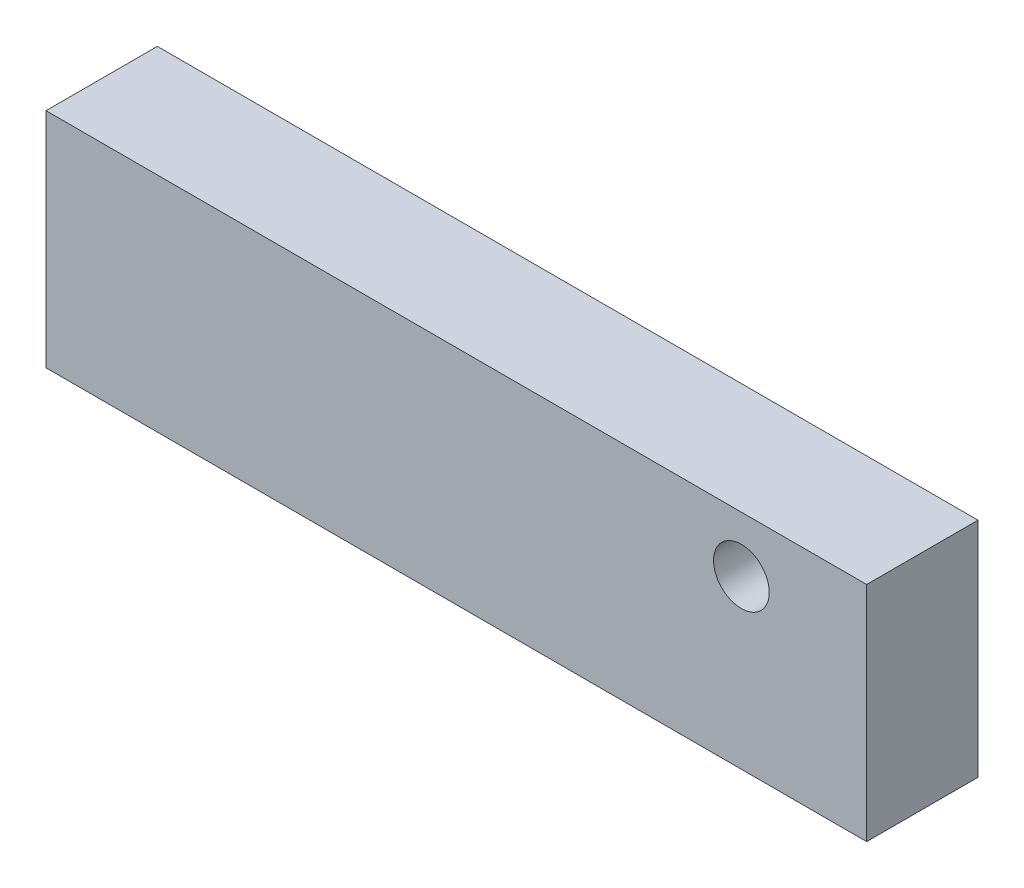
ISO-10303-21;
HEADER;
FILE_DESCRIPTION(('STEP AP214'),'2;1');
FILE_NAME('part.step','',(''),(''),'','','');
FILE_SCHEMA(('AUTOMOTIVE_DESIGN { 1 0 10303 214 1 1 1 1 }'));
ENDSEC;
DATA;
#1=APPLICATION_CONTEXT('core data for automotive mechanical design processes');
#2=APPLICATION_PROTOCOL_DEFINITION('international standard','automotive_design',2000,#1);
#3=PRODUCT_CONTEXT('',#1,'mechanical');
#4=PRODUCT('Part','Part','',(#3));
#5=PRODUCT_RELATED_PRODUCT_CATEGORY('part','',(#4));
#6=PRODUCT_DEFINITION_FORMATION('','',#4);
#7=PRODUCT_DEFINITION_CONTEXT('part definition',#1,'design');
#8=PRODUCT_DEFINITION('design','',#6,#7);
#9=PRODUCT_DEFINITION_SHAPE('','',#8);
#10=(LENGTH_UNIT() NAMED_UNIT(*) SI_UNIT(.MILLI.,.METRE.));
#11=(NAMED_UNIT(*) PLANE_ANGLE_UNIT() SI_UNIT($,.RADIAN.));
#12=(NAMED_UNIT(*) SI_UNIT($,.STERADIAN.) SOLID_ANGLE_UNIT());
#13=UNCERTAINTY_MEASURE_WITH_UNIT(LENGTH_MEASURE(1.E-05),#10,'distance_accuracy_value','');
#14=(GEOMETRIC_REPRESENTATION_CONTEXT(3) GLOBAL_UNCERTAINTY_ASSIGNED_CONTEXT((#13)) GLOBAL_UNIT_ASSIGNED_CONTEXT((#10,
#11,#12)) REPRESENTATION_CONTEXT('',''));
#15=CARTESIAN_POINT('',(0.,0.,0.));
#16=DIRECTION('',(0.,0.,1.));
#17=DIRECTION('',(1.,0.,0.));
#18=AXIS2_PLACEMENT_3D('',#15,#16,#17);
#19=CARTESIAN_POINT('',(0.,0.,25.4));
#20=DIRECTION('',(1.,0.,0.));
#21=DIRECTION('',(0.,0.,-1.));
#22=AXIS2_PLACEMENT_3D('',#19,#20,#21);
#23=PLANE('',#22);
#24=DIRECTION('',(0.,-1.,0.));
#25=VECTOR('',#24,1.);
#26=CARTESIAN_POINT('',(0.,0.,0.));
#27=LINE('',#26,#25);
#28=CARTESIAN_POINT('',(0.,50.8,0.));
#29=VERTEX_POINT('',#28);
#30=CARTESIAN_POINT('',(0.,0.,0.));
#31=VERTEX_POINT('',#30);
#32=EDGE_CURVE('E97',#29,#31,#27,.T.);
#33=ORIENTED_EDGE('',*,*,#32,.T.);
#34=DIRECTION('',(0.,0.,-1.));
#35=VECTOR('',#34,1.);
#36=CARTESIAN_POINT('',(0.,0.,25.4));
#37=LINE('',#36,#35);
#38=CARTESIAN_POINT('',(0.,0.,25.4));
#39=VERTEX_POINT('',#38);
#40=EDGE_CURVE('E11',#39,#31,#37,.T.);
#41=ORIENTED_EDGE('',*,*,#40,.F.);
#42=DIRECTION('',(0.,-1.,0.));
#43=VECTOR('',#42,1.);
#44=CARTESIAN_POINT('',(0.,0.,25.4));
#45=LINE('',#44,#43);
#46=CARTESIAN_POINT('',(0.,50.8,25.4));
#47=VERTEX_POINT('',#46);
#48=EDGE_CURVE('E84',#47,#39,#45,.T.);
#49=ORIENTED_EDGE('',*,*,#48,.F.);
#50=DIRECTION('',(0.,0.,-1.));
#51=VECTOR('',#50,1.);
#52=CARTESIAN_POINT('',(0.,50.8,25.4));
#53=LINE('',#52,#51);
#54=EDGE_CURVE('E93',#47,#29,#53,.T.);
#55=ORIENTED_EDGE('',*,*,#54,.T.);
#56=EDGE_LOOP('',(#33,#41,#49,#55));
#57=FACE_BOUND('',#56,.T.);
#58=ADVANCED_FACE('F32',(#57),#23,.F.);
#59=CARTESIAN_POINT('',(0.,0.,25.4));
#60=DIRECTION('',(0.,1.,0.));
#61=DIRECTION('',(0.,0.,1.));
#62=AXIS2_PLACEMENT_3D('',#59,#60,#61);
#63=PLANE('',#62);
#64=DIRECTION('',(1.,0.,0.));
#65=VECTOR('',#64,1.);
#66=CARTESIAN_POINT('',(0.,0.,0.));
#67=LINE('',#66,#65);
#68=CARTESIAN_POINT('',(187.198,0.,0.));
#69=VERTEX_POINT('',#68);
#70=EDGE_CURVE('E88',#31,#69,#67,.T.);
#71=ORIENTED_EDGE('',*,*,#70,.T.);
#72=DIRECTION('',(0.,0.,-1.));
#73=VECTOR('',#72,1.);
#74=CARTESIAN_POINT('',(187.198,0.,25.4));
#75=LINE('',#74,#73);
#76=CARTESIAN_POINT('',(187.198,0.,25.4));
#77=VERTEX_POINT('',#76);
#78=EDGE_CURVE('E41',#77,#69,#75,.T.);
#79=ORIENTED_EDGE('',*,*,#78,.F.);
#80=DIRECTION('',(1.,0.,0.));
#81=VECTOR('',#80,1.);
#82=CARTESIAN_POINT('',(0.,0.,25.4));
#83=LINE('',#82,#81);
#84=EDGE_CURVE('E79',#39,#77,#83,.T.);
#85=ORIENTED_EDGE('',*,*,#84,.F.);
#86=ORIENTED_EDGE('',*,*,#40,.T.);
#87=EDGE_LOOP('',(#71,#79,#85,#86));
#88=FACE_BOUND('',#87,.T.);
#89=ADVANCED_FACE('F87',(#88),#63,.F.);
#90=CARTESIAN_POINT('',(187.198,0.,25.4));
#91=DIRECTION('',(-1.,0.,0.));
#92=DIRECTION('',(0.,0.,1.));
#93=AXIS2_PLACEMENT_3D('',#90,#91,#92);
#94=PLANE('',#93);
#95=DIRECTION('',(0.,1.,0.));
#96=VECTOR('',#95,1.);
#97=CARTESIAN_POINT('',(187.198,0.,0.));
#98=LINE('',#97,#96);
#99=CARTESIAN_POINT('',(187.198,50.8,0.));
#100=VERTEX_POINT('',#99);
#101=EDGE_CURVE('E66',#69,#100,#98,.T.);
#102=ORIENTED_EDGE('',*,*,#101,.T.);
#103=DIRECTION('',(0.,0.,-1.));
#104=VECTOR('',#103,1.);
#105=CARTESIAN_POINT('',(187.198,50.8,25.4));
#106=LINE('',#105,#104);
#107=CARTESIAN_POINT('',(187.198,50.8,25.4));
#108=VERTEX_POINT('',#107);
#109=EDGE_CURVE('E89',#108,#100,#106,.T.);
#110=ORIENTED_EDGE('',*,*,#109,.F.);
#111=DIRECTION('',(0.,1.,0.));
#112=VECTOR('',#111,1.);
#113=CARTESIAN_POINT('',(187.198,0.,25.4));
#114=LINE('',#113,#112);
#115=EDGE_CURVE('E82',#77,#108,#114,.T.);
#116=ORIENTED_EDGE('',*,*,#115,.F.);
#117=ORIENTED_EDGE('',*,*,#78,.T.);
#118=EDGE_LOOP('',(#102,#110,#116,#117));
#119=FACE_BOUND('',#118,.T.);
#120=ADVANCED_FACE('F91',(#119),#94,.F.);
#121=CARTESIAN_POINT('',(0.,50.8,25.4));
#122=DIRECTION('',(0.,-1.,0.));
#123=DIRECTION('',(0.,0.,-1.));
#124=AXIS2_PLACEMENT_3D('',#121,#122,#123);
#125=PLANE('',#124);
#126=DIRECTION('',(-1.,0.,0.));
#127=VECTOR('',#126,1.);
#128=CARTESIAN_POINT('',(0.,50.8,0.));
#129=LINE('',#128,#127);
#130=EDGE_CURVE('E72',#100,#29,#129,.T.);
#131=ORIENTED_EDGE('',*,*,#130,.T.);
#132=ORIENTED_EDGE('',*,*,#54,.F.);
#133=DIRECTION('',(-1.,0.,0.));
#134=VECTOR('',#133,1.);
#135=CARTESIAN_POINT('',(0.,50.8,25.4));
#136=LINE('',#135,#134);
#137=EDGE_CURVE('E49',#108,#47,#136,.T.);
#138=ORIENTED_EDGE('',*,*,#137,.F.);
#139=ORIENTED_EDGE('',*,*,#109,.T.);
#140=EDGE_LOOP('',(#131,#132,#138,#139));
#141=FACE_BOUND('',#140,.T.);
#142=ADVANCED_FACE('F104',(#141),#125,.F.);
#143=CARTESIAN_POINT('',(0.,0.,25.4));
#144=DIRECTION('',(0.,0.,-1.));
#145=DIRECTION('',(-1.,0.,0.));
#146=AXIS2_PLACEMENT_3D('',#143,#144,#145);
#147=PLANE('',#146);
#148=CARTESIAN_POINT('',(158.623,38.1,25.4));
#149=DIRECTION('',(0.,0.,1.));
#150=DIRECTION('',(1.,0.,0.));
#151=AXIS2_PLACEMENT_3D('',#148,#149,#150);
#152=CIRCLE('',#151,6.35);
#153=CARTESIAN_POINT('',(164.973,38.1,25.4));
#154=VERTEX_POINT('',#153);
#155=EDGE_CURVE('E110',#154,#154,#152,.T.);
#156=ORIENTED_EDGE('',*,*,#155,.F.);
#157=EDGE_LOOP('',(#156));
#158=FACE_BOUND('',#157,.T.);
#159=ORIENTED_EDGE('',*,*,#48,.T.);
#160=ORIENTED_EDGE('',*,*,#84,.T.);
#161=ORIENTED_EDGE('',*,*,#115,.T.);
#162=ORIENTED_EDGE('',*,*,#137,.T.);
#163=EDGE_LOOP('',(#159,#160,#161,#162));
#164=FACE_BOUND('',#163,.T.);
#165=ADVANCED_FACE('F80',(#158,#164),#147,.F.);
#166=CARTESIAN_POINT('',(0.,0.,0.));
#167=DIRECTION('',(0.,0.,-1.));
#168=DIRECTION('',(-1.,0.,0.));
#169=AXIS2_PLACEMENT_3D('',#166,#167,#168);
#170=PLANE('',#169);
#171=CARTESIAN_POINT('',(158.623,38.1,0.));
#172=DIRECTION('',(0.,0.,-1.));
#173=DIRECTION('',(-1.,0.,0.));
#174=AXIS2_PLACEMENT_3D('',#171,#172,#173);
#175=CIRCLE('',#174,6.35);
#176=CARTESIAN_POINT('',(152.273,38.1,0.));
#177=VERTEX_POINT('',#176);
#178=EDGE_CURVE('E35',#177,#177,#175,.T.);
#179=ORIENTED_EDGE('',*,*,#178,.F.);
#180=EDGE_LOOP('',(#179));
#181=FACE_BOUND('',#180,.T.);
#182=ORIENTED_EDGE('',*,*,#32,.F.);
#183=ORIENTED_EDGE('',*,*,#130,.F.);
#184=ORIENTED_EDGE('',*,*,#101,.F.);
#185=ORIENTED_EDGE('',*,*,#70,.F.);
#186=EDGE_LOOP('',(#182,#183,#184,#185));
#187=FACE_BOUND('',#186,.T.);
#188=ADVANCED_FACE('F107',(#181,#187),#170,.T.);
#189=CARTESIAN_POINT('',(158.623,38.1,-228.6));
#190=DIRECTION('',(0.,0.,1.));
#191=DIRECTION('',(1.,0.,0.));
#192=AXIS2_PLACEMENT_3D('',#189,#190,#191);
#193=CYLINDRICAL_SURFACE('',#192,6.35);
#194=ORIENTED_EDGE('',*,*,#178,.T.);
#195=EDGE_LOOP('',(#194));
#196=FACE_BOUND('',#195,.T.);
#197=ORIENTED_EDGE('',*,*,#155,.T.);
#198=EDGE_LOOP('',(#197));
#199=FACE_BOUND('',#198,.T.);
#200=ADVANCED_FACE('F117',(#196,#199),#193,.F.);
#201=CLOSED_SHELL('',(#58,#89,#120,#142,#165,#188,#200));
#202=MANIFOLD_SOLID_BREP('B2',#201);
#203=ADVANCED_BREP_SHAPE_REPRESENTATION('',(#18,#202),#14);
#204=SHAPE_DEFINITION_REPRESENTATION(#9,#203);
ENDSEC;
END-ISO-10303-21;
